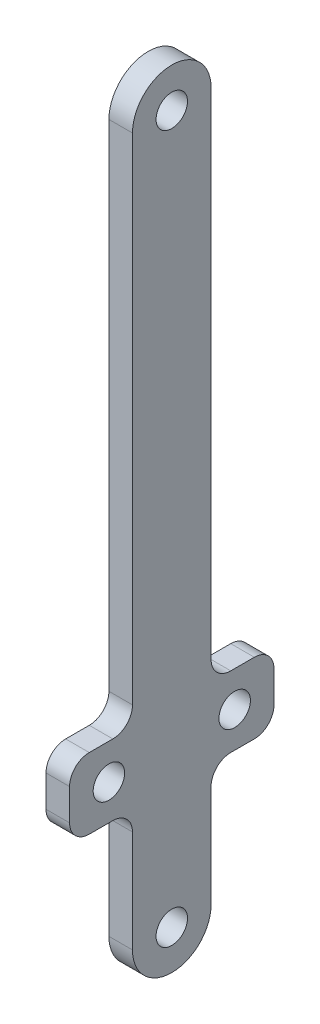
ISO-10303-21;
HEADER;
FILE_DESCRIPTION(('STEP AP214'),'2;1');
FILE_NAME('part.step','',(''),(''),'','','');
FILE_SCHEMA(('AUTOMOTIVE_DESIGN { 1 0 10303 214 1 1 1 1 }'));
ENDSEC;
DATA;
#1=APPLICATION_CONTEXT('core data for automotive mechanical design processes');
#2=APPLICATION_PROTOCOL_DEFINITION('international standard','automotive_design',2000,#1);
#3=PRODUCT_CONTEXT('',#1,'mechanical');
#4=PRODUCT('Part','Part','',(#3));
#5=PRODUCT_RELATED_PRODUCT_CATEGORY('part','',(#4));
#6=PRODUCT_DEFINITION_FORMATION('','',#4);
#7=PRODUCT_DEFINITION_CONTEXT('part definition',#1,'design');
#8=PRODUCT_DEFINITION('design','',#6,#7);
#9=PRODUCT_DEFINITION_SHAPE('','',#8);
#10=(LENGTH_UNIT() NAMED_UNIT(*) SI_UNIT(.MILLI.,.METRE.));
#11=(NAMED_UNIT(*) PLANE_ANGLE_UNIT() SI_UNIT($,.RADIAN.));
#12=(NAMED_UNIT(*) SI_UNIT($,.STERADIAN.) SOLID_ANGLE_UNIT());
#13=UNCERTAINTY_MEASURE_WITH_UNIT(LENGTH_MEASURE(1.E-05),#10,'distance_accuracy_value','');
#14=(GEOMETRIC_REPRESENTATION_CONTEXT(3) GLOBAL_UNCERTAINTY_ASSIGNED_CONTEXT((#13)) GLOBAL_UNIT_ASSIGNED_CONTEXT((#10,
#11,#12)) REPRESENTATION_CONTEXT('',''));
#15=CARTESIAN_POINT('',(0.,0.,0.));
#16=DIRECTION('',(0.,0.,1.));
#17=DIRECTION('',(1.,0.,0.));
#18=AXIS2_PLACEMENT_3D('',#15,#16,#17);
#19=CARTESIAN_POINT('',(6.,49.,0.));
#20=DIRECTION('',(0.,1.,0.));
#21=DIRECTION('',(0.,0.,1.));
#22=AXIS2_PLACEMENT_3D('',#19,#20,#21);
#23=PLANE('',#22);
#24=DIRECTION('',(0.,0.,-1.));
#25=VECTOR('',#24,1.);
#26=CARTESIAN_POINT('',(0.,49.,0.));
#27=LINE('',#26,#25);
#28=CARTESIAN_POINT('',(0.,49.,21.));
#29=VERTEX_POINT('',#28);
#30=CARTESIAN_POINT('',(0.,49.,15.));
#31=VERTEX_POINT('',#30);
#32=EDGE_CURVE('E238',#29,#31,#27,.T.);
#33=ORIENTED_EDGE('',*,*,#32,.F.);
#34=DIRECTION('',(-1.,0.,0.));
#35=VECTOR('',#34,1.);
#36=CARTESIAN_POINT('',(6.,49.,21.));
#37=LINE('',#36,#35);
#38=CARTESIAN_POINT('',(6.,49.,21.));
#39=VERTEX_POINT('',#38);
#40=EDGE_CURVE('E333',#29,#39,#37,.F.);
#41=ORIENTED_EDGE('',*,*,#40,.T.);
#42=DIRECTION('',(0.,0.,-1.));
#43=VECTOR('',#42,1.);
#44=CARTESIAN_POINT('',(6.,49.,0.));
#45=LINE('',#44,#43);
#46=CARTESIAN_POINT('',(6.,49.,15.));
#47=VERTEX_POINT('',#46);
#48=EDGE_CURVE('E358',#39,#47,#45,.T.);
#49=ORIENTED_EDGE('',*,*,#48,.T.);
#50=DIRECTION('',(-1.,0.,0.));
#51=VECTOR('',#50,1.);
#52=CARTESIAN_POINT('',(0.,49.,15.));
#53=LINE('',#52,#51);
#54=EDGE_CURVE('E330',#47,#31,#53,.T.);
#55=ORIENTED_EDGE('',*,*,#54,.T.);
#56=EDGE_LOOP('',(#33,#41,#49,#55));
#57=FACE_BOUND('',#56,.T.);
#58=ADVANCED_FACE('F35',(#57),#23,.T.);
#59=CARTESIAN_POINT('',(6.,0.,26.));
#60=DIRECTION('',(0.,0.,1.));
#61=DIRECTION('',(1.,0.,0.));
#62=AXIS2_PLACEMENT_3D('',#59,#60,#61);
#63=PLANE('',#62);
#64=DIRECTION('',(0.,1.,0.));
#65=VECTOR('',#64,1.);
#66=CARTESIAN_POINT('',(0.,0.,26.));
#67=LINE('',#66,#65);
#68=CARTESIAN_POINT('',(0.,36.,26.));
#69=VERTEX_POINT('',#68);
#70=CARTESIAN_POINT('',(0.,44.,26.));
#71=VERTEX_POINT('',#70);
#72=EDGE_CURVE('E241',#69,#71,#67,.T.);
#73=ORIENTED_EDGE('',*,*,#72,.F.);
#74=DIRECTION('',(-1.,0.,0.));
#75=VECTOR('',#74,1.);
#76=CARTESIAN_POINT('',(6.,36.,26.));
#77=LINE('',#76,#75);
#78=CARTESIAN_POINT('',(6.,36.,26.));
#79=VERTEX_POINT('',#78);
#80=EDGE_CURVE('E328',#69,#79,#77,.F.);
#81=ORIENTED_EDGE('',*,*,#80,.T.);
#82=DIRECTION('',(0.,1.,0.));
#83=VECTOR('',#82,1.);
#84=CARTESIAN_POINT('',(6.,0.,26.));
#85=LINE('',#84,#83);
#86=CARTESIAN_POINT('',(6.,44.,26.));
#87=VERTEX_POINT('',#86);
#88=EDGE_CURVE('E206',#79,#87,#85,.T.);
#89=ORIENTED_EDGE('',*,*,#88,.T.);
#90=DIRECTION('',(-1.,0.,0.));
#91=VECTOR('',#90,1.);
#92=CARTESIAN_POINT('',(6.,44.,26.));
#93=LINE('',#92,#91);
#94=EDGE_CURVE('E325',#87,#71,#93,.T.);
#95=ORIENTED_EDGE('',*,*,#94,.T.);
#96=EDGE_LOOP('',(#73,#81,#89,#95));
#97=FACE_BOUND('',#96,.T.);
#98=ADVANCED_FACE('F384',(#97),#63,.T.);
#99=CARTESIAN_POINT('',(6.,31.,0.));
#100=DIRECTION('',(0.,1.,0.));
#101=DIRECTION('',(0.,0.,1.));
#102=AXIS2_PLACEMENT_3D('',#99,#100,#101);
#103=PLANE('',#102);
#104=DIRECTION('',(0.,0.,-1.));
#105=VECTOR('',#104,1.);
#106=CARTESIAN_POINT('',(0.,31.,0.));
#107=LINE('',#106,#105);
#108=CARTESIAN_POINT('',(0.,31.,21.));
#109=VERTEX_POINT('',#108);
#110=CARTESIAN_POINT('',(0.,31.,15.));
#111=VERTEX_POINT('',#110);
#112=EDGE_CURVE('E244',#109,#111,#107,.T.);
#113=ORIENTED_EDGE('',*,*,#112,.T.);
#114=DIRECTION('',(-1.,0.,0.));
#115=VECTOR('',#114,1.);
#116=CARTESIAN_POINT('',(6.,31.,15.));
#117=LINE('',#116,#115);
#118=CARTESIAN_POINT('',(6.,31.,15.));
#119=VERTEX_POINT('',#118);
#120=EDGE_CURVE('E323',#111,#119,#117,.F.);
#121=ORIENTED_EDGE('',*,*,#120,.T.);
#122=DIRECTION('',(0.,0.,-1.));
#123=VECTOR('',#122,1.);
#124=CARTESIAN_POINT('',(6.,31.,0.));
#125=LINE('',#124,#123);
#126=CARTESIAN_POINT('',(6.,31.,21.));
#127=VERTEX_POINT('',#126);
#128=EDGE_CURVE('E204',#127,#119,#125,.T.);
#129=ORIENTED_EDGE('',*,*,#128,.F.);
#130=DIRECTION('',(-1.,0.,0.));
#131=VECTOR('',#130,1.);
#132=CARTESIAN_POINT('',(0.,31.,21.));
#133=LINE('',#132,#131);
#134=EDGE_CURVE('E320',#127,#109,#133,.T.);
#135=ORIENTED_EDGE('',*,*,#134,.T.);
#136=EDGE_LOOP('',(#113,#121,#129,#135));
#137=FACE_BOUND('',#136,.T.);
#138=ADVANCED_FACE('F389',(#137),#103,.F.);
#139=CARTESIAN_POINT('',(6.,0.,10.));
#140=DIRECTION('',(0.,0.,1.));
#141=DIRECTION('',(1.,0.,0.));
#142=AXIS2_PLACEMENT_3D('',#139,#140,#141);
#143=PLANE('',#142);
#144=DIRECTION('',(0.,1.,0.));
#145=VECTOR('',#144,1.);
#146=CARTESIAN_POINT('',(6.,0.,10.));
#147=LINE('',#146,#145);
#148=CARTESIAN_POINT('',(6.,0.,10.));
#149=VERTEX_POINT('',#148);
#150=CARTESIAN_POINT('',(6.,26.,10.));
#151=VERTEX_POINT('',#150);
#152=EDGE_CURVE('E179',#149,#151,#147,.T.);
#153=ORIENTED_EDGE('',*,*,#152,.T.);
#154=DIRECTION('',(-1.,0.,0.));
#155=VECTOR('',#154,1.);
#156=CARTESIAN_POINT('',(6.,26.,10.));
#157=LINE('',#156,#155);
#158=CARTESIAN_POINT('',(0.,26.,10.));
#159=VERTEX_POINT('',#158);
#160=EDGE_CURVE('E318',#151,#159,#157,.T.);
#161=ORIENTED_EDGE('',*,*,#160,.T.);
#162=DIRECTION('',(0.,1.,0.));
#163=VECTOR('',#162,1.);
#164=CARTESIAN_POINT('',(0.,0.,10.));
#165=LINE('',#164,#163);
#166=CARTESIAN_POINT('',(0.,0.,10.));
#167=VERTEX_POINT('',#166);
#168=EDGE_CURVE('E182',#167,#159,#165,.T.);
#169=ORIENTED_EDGE('',*,*,#168,.F.);
#170=DIRECTION('',(-1.,0.,0.));
#171=VECTOR('',#170,1.);
#172=CARTESIAN_POINT('',(6.,0.,10.));
#173=LINE('',#172,#171);
#174=EDGE_CURVE('E174',#149,#167,#173,.T.);
#175=ORIENTED_EDGE('',*,*,#174,.F.);
#176=EDGE_LOOP('',(#153,#161,#169,#175));
#177=FACE_BOUND('',#176,.T.);
#178=ADVANCED_FACE('F176',(#177),#143,.T.);
#179=CARTESIAN_POINT('',(6.,0.,0.));
#180=DIRECTION('',(-1.,0.,0.));
#181=DIRECTION('',(0.,0.,1.));
#182=AXIS2_PLACEMENT_3D('',#179,#180,#181);
#183=CYLINDRICAL_SURFACE('',#182,10.);
#184=CARTESIAN_POINT('',(0.,0.,0.));
#185=DIRECTION('',(1.,0.,0.));
#186=DIRECTION('',(0.,0.,-1.));
#187=AXIS2_PLACEMENT_3D('',#184,#185,#186);
#188=CIRCLE('',#187,10.);
#189=CARTESIAN_POINT('',(0.,0.,-10.));
#190=VERTEX_POINT('',#189);
#191=EDGE_CURVE('E248',#167,#190,#188,.T.);
#192=ORIENTED_EDGE('',*,*,#191,.T.);
#193=DIRECTION('',(-1.,0.,0.));
#194=VECTOR('',#193,1.);
#195=CARTESIAN_POINT('',(6.,0.,-10.));
#196=LINE('',#195,#194);
#197=CARTESIAN_POINT('',(6.,0.,-10.));
#198=VERTEX_POINT('',#197);
#199=EDGE_CURVE('E187',#198,#190,#196,.T.);
#200=ORIENTED_EDGE('',*,*,#199,.F.);
#201=CARTESIAN_POINT('',(6.,0.,0.));
#202=DIRECTION('',(1.,0.,0.));
#203=DIRECTION('',(0.,0.,-1.));
#204=AXIS2_PLACEMENT_3D('',#201,#202,#203);
#205=CIRCLE('',#204,10.);
#206=EDGE_CURVE('E191',#149,#198,#205,.T.);
#207=ORIENTED_EDGE('',*,*,#206,.F.);
#208=ORIENTED_EDGE('',*,*,#174,.T.);
#209=EDGE_LOOP('',(#192,#200,#207,#208));
#210=FACE_BOUND('',#209,.T.);
#211=ADVANCED_FACE('F192',(#210),#183,.T.);
#212=CARTESIAN_POINT('',(6.,0.,-10.));
#213=DIRECTION('',(0.,0.,1.));
#214=DIRECTION('',(1.,0.,0.));
#215=AXIS2_PLACEMENT_3D('',#212,#213,#214);
#216=PLANE('',#215);
#217=DIRECTION('',(0.,1.,0.));
#218=VECTOR('',#217,1.);
#219=CARTESIAN_POINT('',(0.,0.,-10.));
#220=LINE('',#219,#218);
#221=CARTESIAN_POINT('',(0.,26.,-10.));
#222=VERTEX_POINT('',#221);
#223=EDGE_CURVE('E250',#190,#222,#220,.T.);
#224=ORIENTED_EDGE('',*,*,#223,.T.);
#225=DIRECTION('',(-1.,0.,0.));
#226=VECTOR('',#225,1.);
#227=CARTESIAN_POINT('',(6.,26.,-10.));
#228=LINE('',#227,#226);
#229=CARTESIAN_POINT('',(6.,26.,-10.));
#230=VERTEX_POINT('',#229);
#231=EDGE_CURVE('E316',#222,#230,#228,.F.);
#232=ORIENTED_EDGE('',*,*,#231,.T.);
#233=DIRECTION('',(0.,1.,0.));
#234=VECTOR('',#233,1.);
#235=CARTESIAN_POINT('',(6.,0.,-10.));
#236=LINE('',#235,#234);
#237=EDGE_CURVE('E196',#198,#230,#236,.T.);
#238=ORIENTED_EDGE('',*,*,#237,.F.);
#239=ORIENTED_EDGE('',*,*,#199,.T.);
#240=EDGE_LOOP('',(#224,#232,#238,#239));
#241=FACE_BOUND('',#240,.T.);
#242=ADVANCED_FACE('F437',(#241),#216,.F.);
#243=CARTESIAN_POINT('',(6.,31.,0.));
#244=DIRECTION('',(0.,1.,0.));
#245=DIRECTION('',(0.,0.,1.));
#246=AXIS2_PLACEMENT_3D('',#243,#244,#245);
#247=PLANE('',#246);
#248=DIRECTION('',(0.,0.,-1.));
#249=VECTOR('',#248,1.);
#250=CARTESIAN_POINT('',(0.,31.,0.));
#251=LINE('',#250,#249);
#252=CARTESIAN_POINT('',(0.,31.,-15.));
#253=VERTEX_POINT('',#252);
#254=CARTESIAN_POINT('',(0.,31.,-21.));
#255=VERTEX_POINT('',#254);
#256=EDGE_CURVE('E253',#253,#255,#251,.T.);
#257=ORIENTED_EDGE('',*,*,#256,.T.);
#258=DIRECTION('',(-1.,0.,0.));
#259=VECTOR('',#258,1.);
#260=CARTESIAN_POINT('',(6.,31.,-21.));
#261=LINE('',#260,#259);
#262=CARTESIAN_POINT('',(6.,31.,-21.));
#263=VERTEX_POINT('',#262);
#264=EDGE_CURVE('E58',#255,#263,#261,.F.);
#265=ORIENTED_EDGE('',*,*,#264,.T.);
#266=DIRECTION('',(0.,0.,-1.));
#267=VECTOR('',#266,1.);
#268=CARTESIAN_POINT('',(6.,31.,0.));
#269=LINE('',#268,#267);
#270=CARTESIAN_POINT('',(6.,31.,-15.));
#271=VERTEX_POINT('',#270);
#272=EDGE_CURVE('E211',#271,#263,#269,.T.);
#273=ORIENTED_EDGE('',*,*,#272,.F.);
#274=DIRECTION('',(-1.,0.,0.));
#275=VECTOR('',#274,1.);
#276=CARTESIAN_POINT('',(0.,31.,-15.));
#277=LINE('',#276,#275);
#278=EDGE_CURVE('E312',#271,#253,#277,.T.);
#279=ORIENTED_EDGE('',*,*,#278,.T.);
#280=EDGE_LOOP('',(#257,#265,#273,#279));
#281=FACE_BOUND('',#280,.T.);
#282=ADVANCED_FACE('F440',(#281),#247,.F.);
#283=CARTESIAN_POINT('',(6.,0.,-26.));
#284=DIRECTION('',(0.,0.,1.));
#285=DIRECTION('',(1.,0.,0.));
#286=AXIS2_PLACEMENT_3D('',#283,#284,#285);
#287=PLANE('',#286);
#288=DIRECTION('',(0.,1.,0.));
#289=VECTOR('',#288,1.);
#290=CARTESIAN_POINT('',(0.,0.,-26.));
#291=LINE('',#290,#289);
#292=CARTESIAN_POINT('',(0.,36.,-26.));
#293=VERTEX_POINT('',#292);
#294=CARTESIAN_POINT('',(0.,44.,-26.));
#295=VERTEX_POINT('',#294);
#296=EDGE_CURVE('E255',#293,#295,#291,.T.);
#297=ORIENTED_EDGE('',*,*,#296,.T.);
#298=DIRECTION('',(-1.,0.,0.));
#299=VECTOR('',#298,1.);
#300=CARTESIAN_POINT('',(6.,44.,-26.));
#301=LINE('',#300,#299);
#302=CARTESIAN_POINT('',(6.,44.,-26.));
#303=VERTEX_POINT('',#302);
#304=EDGE_CURVE('E302',#295,#303,#301,.F.);
#305=ORIENTED_EDGE('',*,*,#304,.T.);
#306=DIRECTION('',(0.,1.,0.));
#307=VECTOR('',#306,1.);
#308=CARTESIAN_POINT('',(6.,0.,-26.));
#309=LINE('',#308,#307);
#310=CARTESIAN_POINT('',(6.,36.,-26.));
#311=VERTEX_POINT('',#310);
#312=EDGE_CURVE('E213',#311,#303,#309,.T.);
#313=ORIENTED_EDGE('',*,*,#312,.F.);
#314=DIRECTION('',(-1.,0.,0.));
#315=VECTOR('',#314,1.);
#316=CARTESIAN_POINT('',(6.,36.,-26.));
#317=LINE('',#316,#315);
#318=EDGE_CURVE('E299',#311,#293,#317,.T.);
#319=ORIENTED_EDGE('',*,*,#318,.T.);
#320=EDGE_LOOP('',(#297,#305,#313,#319));
#321=FACE_BOUND('',#320,.T.);
#322=ADVANCED_FACE('F446',(#321),#287,.F.);
#323=CARTESIAN_POINT('',(6.,49.,0.));
#324=DIRECTION('',(0.,1.,0.));
#325=DIRECTION('',(0.,0.,1.));
#326=AXIS2_PLACEMENT_3D('',#323,#324,#325);
#327=PLANE('',#326);
#328=DIRECTION('',(0.,0.,-1.));
#329=VECTOR('',#328,1.);
#330=CARTESIAN_POINT('',(0.,49.,0.));
#331=LINE('',#330,#329);
#332=CARTESIAN_POINT('',(0.,49.,-15.));
#333=VERTEX_POINT('',#332);
#334=CARTESIAN_POINT('',(0.,49.,-21.));
#335=VERTEX_POINT('',#334);
#336=EDGE_CURVE('E258',#333,#335,#331,.T.);
#337=ORIENTED_EDGE('',*,*,#336,.F.);
#338=DIRECTION('',(-1.,0.,0.));
#339=VECTOR('',#338,1.);
#340=CARTESIAN_POINT('',(6.,49.,-15.));
#341=LINE('',#340,#339);
#342=CARTESIAN_POINT('',(6.,49.,-15.));
#343=VERTEX_POINT('',#342);
#344=EDGE_CURVE('E289',#333,#343,#341,.F.);
#345=ORIENTED_EDGE('',*,*,#344,.T.);
#346=DIRECTION('',(0.,0.,-1.));
#347=VECTOR('',#346,1.);
#348=CARTESIAN_POINT('',(6.,49.,0.));
#349=LINE('',#348,#347);
#350=CARTESIAN_POINT('',(6.,49.,-21.));
#351=VERTEX_POINT('',#350);
#352=EDGE_CURVE('E215',#343,#351,#349,.T.);
#353=ORIENTED_EDGE('',*,*,#352,.T.);
#354=DIRECTION('',(-1.,0.,0.));
#355=VECTOR('',#354,1.);
#356=CARTESIAN_POINT('',(0.,49.,-21.));
#357=LINE('',#356,#355);
#358=EDGE_CURVE('E286',#351,#335,#357,.T.);
#359=ORIENTED_EDGE('',*,*,#358,.T.);
#360=EDGE_LOOP('',(#337,#345,#353,#359));
#361=FACE_BOUND('',#360,.T.);
#362=ADVANCED_FACE('F453',(#361),#327,.T.);
#363=CARTESIAN_POINT('',(6.,0.,-10.));
#364=DIRECTION('',(0.,0.,1.));
#365=DIRECTION('',(1.,0.,0.));
#366=AXIS2_PLACEMENT_3D('',#363,#364,#365);
#367=PLANE('',#366);
#368=DIRECTION('',(0.,1.,0.));
#369=VECTOR('',#368,1.);
#370=CARTESIAN_POINT('',(6.,0.,-10.));
#371=LINE('',#370,#369);
#372=CARTESIAN_POINT('',(6.,54.,-10.));
#373=VERTEX_POINT('',#372);
#374=CARTESIAN_POINT('',(6.,180.,-10.));
#375=VERTEX_POINT('',#374);
#376=EDGE_CURVE('E218',#373,#375,#371,.T.);
#377=ORIENTED_EDGE('',*,*,#376,.F.);
#378=DIRECTION('',(-1.,0.,0.));
#379=VECTOR('',#378,1.);
#380=CARTESIAN_POINT('',(6.,54.,-10.));
#381=LINE('',#380,#379);
#382=CARTESIAN_POINT('',(0.,54.,-10.));
#383=VERTEX_POINT('',#382);
#384=EDGE_CURVE('E186',#373,#383,#381,.T.);
#385=ORIENTED_EDGE('',*,*,#384,.T.);
#386=DIRECTION('',(0.,1.,0.));
#387=VECTOR('',#386,1.);
#388=CARTESIAN_POINT('',(0.,0.,-10.));
#389=LINE('',#388,#387);
#390=CARTESIAN_POINT('',(0.,180.,-10.));
#391=VERTEX_POINT('',#390);
#392=EDGE_CURVE('E261',#383,#391,#389,.T.);
#393=ORIENTED_EDGE('',*,*,#392,.T.);
#394=DIRECTION('',(-1.,0.,0.));
#395=VECTOR('',#394,1.);
#396=CARTESIAN_POINT('',(6.,180.,-10.));
#397=LINE('',#396,#395);
#398=EDGE_CURVE('E280',#375,#391,#397,.T.);
#399=ORIENTED_EDGE('',*,*,#398,.F.);
#400=EDGE_LOOP('',(#377,#385,#393,#399));
#401=FACE_BOUND('',#400,.T.);
#402=ADVANCED_FACE('F460',(#401),#367,.F.);
#403=CARTESIAN_POINT('',(6.,180.,0.));
#404=DIRECTION('',(-1.,0.,0.));
#405=DIRECTION('',(0.,0.,1.));
#406=AXIS2_PLACEMENT_3D('',#403,#404,#405);
#407=CYLINDRICAL_SURFACE('',#406,10.);
#408=CARTESIAN_POINT('',(0.,180.,0.));
#409=DIRECTION('',(1.,0.,0.));
#410=DIRECTION('',(0.,0.,-1.));
#411=AXIS2_PLACEMENT_3D('',#408,#409,#410);
#412=CIRCLE('',#411,10.);
#413=CARTESIAN_POINT('',(0.,180.,10.));
#414=VERTEX_POINT('',#413);
#415=EDGE_CURVE('E263',#391,#414,#412,.T.);
#416=ORIENTED_EDGE('',*,*,#415,.T.);
#417=DIRECTION('',(-1.,0.,0.));
#418=VECTOR('',#417,1.);
#419=CARTESIAN_POINT('',(6.,180.,10.));
#420=LINE('',#419,#418);
#421=CARTESIAN_POINT('',(6.,180.,10.));
#422=VERTEX_POINT('',#421);
#423=EDGE_CURVE('E234',#422,#414,#420,.T.);
#424=ORIENTED_EDGE('',*,*,#423,.F.);
#425=CARTESIAN_POINT('',(6.,180.,0.));
#426=DIRECTION('',(1.,0.,0.));
#427=DIRECTION('',(0.,0.,-1.));
#428=AXIS2_PLACEMENT_3D('',#425,#426,#427);
#429=CIRCLE('',#428,10.);
#430=EDGE_CURVE('E220',#375,#422,#429,.T.);
#431=ORIENTED_EDGE('',*,*,#430,.F.);
#432=ORIENTED_EDGE('',*,*,#398,.T.);
#433=EDGE_LOOP('',(#416,#424,#431,#432));
#434=FACE_BOUND('',#433,.T.);
#435=ADVANCED_FACE('F464',(#434),#407,.T.);
#436=CARTESIAN_POINT('',(6.,0.,0.));
#437=DIRECTION('',(-1.,0.,0.));
#438=DIRECTION('',(0.,0.,1.));
#439=AXIS2_PLACEMENT_3D('',#436,#437,#438);
#440=CYLINDRICAL_SURFACE('',#439,4.);
#441=CARTESIAN_POINT('',(6.,0.,0.));
#442=DIRECTION('',(1.,0.,0.));
#443=DIRECTION('',(0.,0.,-1.));
#444=AXIS2_PLACEMENT_3D('',#441,#442,#443);
#445=CIRCLE('',#444,4.);
#446=CARTESIAN_POINT('',(6.,0.,-4.));
#447=VERTEX_POINT('',#446);
#448=EDGE_CURVE('E228',#447,#447,#445,.T.);
#449=ORIENTED_EDGE('',*,*,#448,.T.);
#450=EDGE_LOOP('',(#449));
#451=FACE_BOUND('',#450,.T.);
#452=CARTESIAN_POINT('',(0.,0.,0.));
#453=DIRECTION('',(1.,0.,0.));
#454=DIRECTION('',(0.,0.,-1.));
#455=AXIS2_PLACEMENT_3D('',#452,#453,#454);
#456=CIRCLE('',#455,4.);
#457=CARTESIAN_POINT('',(0.,0.,-4.));
#458=VERTEX_POINT('',#457);
#459=EDGE_CURVE('E271',#458,#458,#456,.T.);
#460=ORIENTED_EDGE('',*,*,#459,.F.);
#461=EDGE_LOOP('',(#460));
#462=FACE_BOUND('',#461,.T.);
#463=ADVANCED_FACE('F466',(#451,#462),#440,.F.);
#464=CARTESIAN_POINT('',(6.,40.,-16.));
#465=DIRECTION('',(-1.,0.,0.));
#466=DIRECTION('',(0.,0.,1.));
#467=AXIS2_PLACEMENT_3D('',#464,#465,#466);
#468=CYLINDRICAL_SURFACE('',#467,4.);
#469=CARTESIAN_POINT('',(6.,40.,-16.));
#470=DIRECTION('',(1.,0.,0.));
#471=DIRECTION('',(0.,0.,-1.));
#472=AXIS2_PLACEMENT_3D('',#469,#470,#471);
#473=CIRCLE('',#472,4.);
#474=CARTESIAN_POINT('',(6.,40.,-20.));
#475=VERTEX_POINT('',#474);
#476=EDGE_CURVE('E225',#475,#475,#473,.F.);
#477=ORIENTED_EDGE('',*,*,#476,.F.);
#478=EDGE_LOOP('',(#477));
#479=FACE_BOUND('',#478,.T.);
#480=CARTESIAN_POINT('',(0.,40.,-16.));
#481=DIRECTION('',(1.,0.,0.));
#482=DIRECTION('',(0.,0.,-1.));
#483=AXIS2_PLACEMENT_3D('',#480,#481,#482);
#484=CIRCLE('',#483,4.);
#485=CARTESIAN_POINT('',(0.,40.,-20.));
#486=VERTEX_POINT('',#485);
#487=EDGE_CURVE('E268',#486,#486,#484,.F.);
#488=ORIENTED_EDGE('',*,*,#487,.T.);
#489=EDGE_LOOP('',(#488));
#490=FACE_BOUND('',#489,.T.);
#491=ADVANCED_FACE('F472',(#479,#490),#468,.F.);
#492=CARTESIAN_POINT('',(6.,0.,10.));
#493=DIRECTION('',(0.,0.,1.));
#494=DIRECTION('',(1.,0.,0.));
#495=AXIS2_PLACEMENT_3D('',#492,#493,#494);
#496=PLANE('',#495);
#497=DIRECTION('',(0.,1.,0.));
#498=VECTOR('',#497,1.);
#499=CARTESIAN_POINT('',(0.,0.,10.));
#500=LINE('',#499,#498);
#501=CARTESIAN_POINT('',(0.,54.,10.));
#502=VERTEX_POINT('',#501);
#503=EDGE_CURVE('E266',#502,#414,#500,.T.);
#504=ORIENTED_EDGE('',*,*,#503,.F.);
#505=DIRECTION('',(-1.,0.,0.));
#506=VECTOR('',#505,1.);
#507=CARTESIAN_POINT('',(6.,54.,10.));
#508=LINE('',#507,#506);
#509=CARTESIAN_POINT('',(6.,54.,10.));
#510=VERTEX_POINT('',#509);
#511=EDGE_CURVE('E50',#502,#510,#508,.F.);
#512=ORIENTED_EDGE('',*,*,#511,.T.);
#513=DIRECTION('',(0.,1.,0.));
#514=VECTOR('',#513,1.);
#515=CARTESIAN_POINT('',(6.,0.,10.));
#516=LINE('',#515,#514);
#517=EDGE_CURVE('E223',#510,#422,#516,.T.);
#518=ORIENTED_EDGE('',*,*,#517,.T.);
#519=ORIENTED_EDGE('',*,*,#423,.T.);
#520=EDGE_LOOP('',(#504,#512,#518,#519));
#521=FACE_BOUND('',#520,.T.);
#522=ADVANCED_FACE('F353',(#521),#496,.T.);
#523=CARTESIAN_POINT('',(6.,40.,16.));
#524=DIRECTION('',(-1.,0.,0.));
#525=DIRECTION('',(0.,0.,1.));
#526=AXIS2_PLACEMENT_3D('',#523,#524,#525);
#527=CYLINDRICAL_SURFACE('',#526,4.);
#528=CARTESIAN_POINT('',(6.,40.,16.));
#529=DIRECTION('',(1.,0.,0.));
#530=DIRECTION('',(0.,0.,-1.));
#531=AXIS2_PLACEMENT_3D('',#528,#529,#530);
#532=CIRCLE('',#531,4.);
#533=CARTESIAN_POINT('',(6.,40.,12.));
#534=VERTEX_POINT('',#533);
#535=EDGE_CURVE('E277',#534,#534,#532,.T.);
#536=ORIENTED_EDGE('',*,*,#535,.T.);
#537=EDGE_LOOP('',(#536));
#538=FACE_BOUND('',#537,.T.);
#539=CARTESIAN_POINT('',(0.,40.,16.));
#540=DIRECTION('',(1.,0.,0.));
#541=DIRECTION('',(0.,0.,-1.));
#542=AXIS2_PLACEMENT_3D('',#539,#540,#541);
#543=CIRCLE('',#542,4.);
#544=CARTESIAN_POINT('',(0.,40.,12.));
#545=VERTEX_POINT('',#544);
#546=EDGE_CURVE('E235',#545,#545,#543,.T.);
#547=ORIENTED_EDGE('',*,*,#546,.F.);
#548=EDGE_LOOP('',(#547));
#549=FACE_BOUND('',#548,.T.);
#550=ADVANCED_FACE('F368',(#538,#549),#527,.F.);
#551=CARTESIAN_POINT('',(6.,180.,0.));
#552=DIRECTION('',(-1.,0.,0.));
#553=DIRECTION('',(0.,0.,1.));
#554=AXIS2_PLACEMENT_3D('',#551,#552,#553);
#555=CYLINDRICAL_SURFACE('',#554,4.);
#556=CARTESIAN_POINT('',(6.,180.,0.));
#557=DIRECTION('',(1.,0.,0.));
#558=DIRECTION('',(0.,0.,-1.));
#559=AXIS2_PLACEMENT_3D('',#556,#557,#558);
#560=CIRCLE('',#559,4.);
#561=CARTESIAN_POINT('',(6.,180.,-4.));
#562=VERTEX_POINT('',#561);
#563=EDGE_CURVE('E231',#562,#562,#560,.T.);
#564=ORIENTED_EDGE('',*,*,#563,.T.);
#565=EDGE_LOOP('',(#564));
#566=FACE_BOUND('',#565,.T.);
#567=CARTESIAN_POINT('',(0.,180.,0.));
#568=DIRECTION('',(1.,0.,0.));
#569=DIRECTION('',(0.,0.,-1.));
#570=AXIS2_PLACEMENT_3D('',#567,#568,#569);
#571=CIRCLE('',#570,4.);
#572=CARTESIAN_POINT('',(0.,180.,-4.));
#573=VERTEX_POINT('',#572);
#574=EDGE_CURVE('E274',#573,#573,#571,.T.);
#575=ORIENTED_EDGE('',*,*,#574,.F.);
#576=EDGE_LOOP('',(#575));
#577=FACE_BOUND('',#576,.T.);
#578=ADVANCED_FACE('F372',(#566,#577),#555,.F.);
#579=CARTESIAN_POINT('',(6.,0.,0.));
#580=DIRECTION('',(1.,0.,0.));
#581=DIRECTION('',(0.,0.,-1.));
#582=AXIS2_PLACEMENT_3D('',#579,#580,#581);
#583=PLANE('',#582);
#584=ORIENTED_EDGE('',*,*,#535,.F.);
#585=EDGE_LOOP('',(#584));
#586=FACE_BOUND('',#585,.T.);
#587=ORIENTED_EDGE('',*,*,#312,.T.);
#588=CARTESIAN_POINT('',(6.,44.,-21.));
#589=DIRECTION('',(1.,0.,0.));
#590=DIRECTION('',(0.,0.,-1.));
#591=AXIS2_PLACEMENT_3D('',#588,#589,#590);
#592=CIRCLE('',#591,5.);
#593=EDGE_CURVE('E310',#303,#351,#592,.T.);
#594=ORIENTED_EDGE('',*,*,#593,.T.);
#595=ORIENTED_EDGE('',*,*,#352,.F.);
#596=CARTESIAN_POINT('',(6.,54.,-15.));
#597=DIRECTION('',(1.,0.,0.));
#598=DIRECTION('',(0.,0.,-1.));
#599=AXIS2_PLACEMENT_3D('',#596,#597,#598);
#600=CIRCLE('',#599,5.);
#601=EDGE_CURVE('E338',#343,#373,#600,.F.);
#602=ORIENTED_EDGE('',*,*,#601,.T.);
#603=ORIENTED_EDGE('',*,*,#376,.T.);
#604=ORIENTED_EDGE('',*,*,#430,.T.);
#605=ORIENTED_EDGE('',*,*,#517,.F.);
#606=CARTESIAN_POINT('',(6.,54.,15.));
#607=DIRECTION('',(1.,0.,0.));
#608=DIRECTION('',(0.,0.,-1.));
#609=AXIS2_PLACEMENT_3D('',#606,#607,#608);
#610=CIRCLE('',#609,5.);
#611=EDGE_CURVE('E11',#510,#47,#610,.F.);
#612=ORIENTED_EDGE('',*,*,#611,.T.);
#613=ORIENTED_EDGE('',*,*,#48,.F.);
#614=CARTESIAN_POINT('',(6.,44.,21.));
#615=DIRECTION('',(1.,0.,0.));
#616=DIRECTION('',(0.,0.,-1.));
#617=AXIS2_PLACEMENT_3D('',#614,#615,#616);
#618=CIRCLE('',#617,5.);
#619=EDGE_CURVE('E304',#39,#87,#618,.T.);
#620=ORIENTED_EDGE('',*,*,#619,.T.);
#621=ORIENTED_EDGE('',*,*,#88,.F.);
#622=CARTESIAN_POINT('',(6.,36.,21.));
#623=DIRECTION('',(1.,0.,0.));
#624=DIRECTION('',(0.,0.,-1.));
#625=AXIS2_PLACEMENT_3D('',#622,#623,#624);
#626=CIRCLE('',#625,5.);
#627=EDGE_CURVE('E306',#79,#127,#626,.T.);
#628=ORIENTED_EDGE('',*,*,#627,.T.);
#629=ORIENTED_EDGE('',*,*,#128,.T.);
#630=CARTESIAN_POINT('',(6.,26.,15.));
#631=DIRECTION('',(1.,0.,0.));
#632=DIRECTION('',(0.,0.,-1.));
#633=AXIS2_PLACEMENT_3D('',#630,#631,#632);
#634=CIRCLE('',#633,5.);
#635=EDGE_CURVE('E203',#119,#151,#634,.F.);
#636=ORIENTED_EDGE('',*,*,#635,.T.);
#637=ORIENTED_EDGE('',*,*,#152,.F.);
#638=ORIENTED_EDGE('',*,*,#206,.T.);
#639=ORIENTED_EDGE('',*,*,#237,.T.);
#640=CARTESIAN_POINT('',(6.,26.,-15.));
#641=DIRECTION('',(1.,0.,0.));
#642=DIRECTION('',(0.,0.,-1.));
#643=AXIS2_PLACEMENT_3D('',#640,#641,#642);
#644=CIRCLE('',#643,5.);
#645=EDGE_CURVE('E342',#230,#271,#644,.F.);
#646=ORIENTED_EDGE('',*,*,#645,.T.);
#647=ORIENTED_EDGE('',*,*,#272,.T.);
#648=CARTESIAN_POINT('',(6.,36.,-21.));
#649=DIRECTION('',(1.,0.,0.));
#650=DIRECTION('',(0.,0.,-1.));
#651=AXIS2_PLACEMENT_3D('',#648,#649,#650);
#652=CIRCLE('',#651,5.);
#653=EDGE_CURVE('E308',#263,#311,#652,.T.);
#654=ORIENTED_EDGE('',*,*,#653,.T.);
#655=EDGE_LOOP('',(#587,#594,#595,#602,#603,#604,#605,#612,#613,#620,#621,#628,#629,#636,#637,
#638,#639,#646,#647,#654));
#656=FACE_BOUND('',#655,.T.);
#657=ORIENTED_EDGE('',*,*,#476,.T.);
#658=EDGE_LOOP('',(#657));
#659=FACE_BOUND('',#658,.T.);
#660=ORIENTED_EDGE('',*,*,#448,.F.);
#661=EDGE_LOOP('',(#660));
#662=FACE_BOUND('',#661,.T.);
#663=ORIENTED_EDGE('',*,*,#563,.F.);
#664=EDGE_LOOP('',(#663));
#665=FACE_BOUND('',#664,.T.);
#666=ADVANCED_FACE('F199',(#586,#656,#659,#662,#665),#583,.T.);
#667=CARTESIAN_POINT('',(0.,0.,0.));
#668=DIRECTION('',(1.,0.,0.));
#669=DIRECTION('',(0.,0.,-1.));
#670=AXIS2_PLACEMENT_3D('',#667,#668,#669);
#671=PLANE('',#670);
#672=ORIENTED_EDGE('',*,*,#546,.T.);
#673=EDGE_LOOP('',(#672));
#674=FACE_BOUND('',#673,.T.);
#675=ORIENTED_EDGE('',*,*,#336,.T.);
#676=CARTESIAN_POINT('',(0.,44.,-21.));
#677=DIRECTION('',(1.,0.,0.));
#678=DIRECTION('',(0.,0.,-1.));
#679=AXIS2_PLACEMENT_3D('',#676,#677,#678);
#680=CIRCLE('',#679,5.);
#681=EDGE_CURVE('E297',#335,#295,#680,.F.);
#682=ORIENTED_EDGE('',*,*,#681,.T.);
#683=ORIENTED_EDGE('',*,*,#296,.F.);
#684=CARTESIAN_POINT('',(0.,36.,-21.));
#685=DIRECTION('',(1.,0.,0.));
#686=DIRECTION('',(0.,0.,-1.));
#687=AXIS2_PLACEMENT_3D('',#684,#685,#686);
#688=CIRCLE('',#687,5.);
#689=EDGE_CURVE('E295',#293,#255,#688,.F.);
#690=ORIENTED_EDGE('',*,*,#689,.T.);
#691=ORIENTED_EDGE('',*,*,#256,.F.);
#692=CARTESIAN_POINT('',(0.,26.,-15.));
#693=DIRECTION('',(1.,0.,0.));
#694=DIRECTION('',(0.,0.,-1.));
#695=AXIS2_PLACEMENT_3D('',#692,#693,#694);
#696=CIRCLE('',#695,5.);
#697=EDGE_CURVE('E340',#253,#222,#696,.T.);
#698=ORIENTED_EDGE('',*,*,#697,.T.);
#699=ORIENTED_EDGE('',*,*,#223,.F.);
#700=ORIENTED_EDGE('',*,*,#191,.F.);
#701=ORIENTED_EDGE('',*,*,#168,.T.);
#702=CARTESIAN_POINT('',(0.,26.,15.));
#703=DIRECTION('',(1.,0.,0.));
#704=DIRECTION('',(0.,0.,-1.));
#705=AXIS2_PLACEMENT_3D('',#702,#703,#704);
#706=CIRCLE('',#705,5.);
#707=EDGE_CURVE('E344',#159,#111,#706,.T.);
#708=ORIENTED_EDGE('',*,*,#707,.T.);
#709=ORIENTED_EDGE('',*,*,#112,.F.);
#710=CARTESIAN_POINT('',(0.,36.,21.));
#711=DIRECTION('',(1.,0.,0.));
#712=DIRECTION('',(0.,0.,-1.));
#713=AXIS2_PLACEMENT_3D('',#710,#711,#712);
#714=CIRCLE('',#713,5.);
#715=EDGE_CURVE('E293',#109,#69,#714,.F.);
#716=ORIENTED_EDGE('',*,*,#715,.T.);
#717=ORIENTED_EDGE('',*,*,#72,.T.);
#718=CARTESIAN_POINT('',(0.,44.,21.));
#719=DIRECTION('',(1.,0.,0.));
#720=DIRECTION('',(0.,0.,-1.));
#721=AXIS2_PLACEMENT_3D('',#718,#719,#720);
#722=CIRCLE('',#721,5.);
#723=EDGE_CURVE('E291',#71,#29,#722,.F.);
#724=ORIENTED_EDGE('',*,*,#723,.T.);
#725=ORIENTED_EDGE('',*,*,#32,.T.);
#726=CARTESIAN_POINT('',(0.,54.,15.));
#727=DIRECTION('',(1.,0.,0.));
#728=DIRECTION('',(0.,0.,-1.));
#729=AXIS2_PLACEMENT_3D('',#726,#727,#728);
#730=CIRCLE('',#729,5.);
#731=EDGE_CURVE('E43',#31,#502,#730,.T.);
#732=ORIENTED_EDGE('',*,*,#731,.T.);
#733=ORIENTED_EDGE('',*,*,#503,.T.);
#734=ORIENTED_EDGE('',*,*,#415,.F.);
#735=ORIENTED_EDGE('',*,*,#392,.F.);
#736=CARTESIAN_POINT('',(0.,54.,-15.));
#737=DIRECTION('',(1.,0.,0.));
#738=DIRECTION('',(0.,0.,-1.));
#739=AXIS2_PLACEMENT_3D('',#736,#737,#738);
#740=CIRCLE('',#739,5.);
#741=EDGE_CURVE('E336',#383,#333,#740,.T.);
#742=ORIENTED_EDGE('',*,*,#741,.T.);
#743=EDGE_LOOP('',(#675,#682,#683,#690,#691,#698,#699,#700,#701,#708,#709,#716,#717,#724,#725,
#732,#733,#734,#735,#742));
#744=FACE_BOUND('',#743,.T.);
#745=ORIENTED_EDGE('',*,*,#487,.F.);
#746=EDGE_LOOP('',(#745));
#747=FACE_BOUND('',#746,.T.);
#748=ORIENTED_EDGE('',*,*,#459,.T.);
#749=EDGE_LOOP('',(#748));
#750=FACE_BOUND('',#749,.T.);
#751=ORIENTED_EDGE('',*,*,#574,.T.);
#752=EDGE_LOOP('',(#751));
#753=FACE_BOUND('',#752,.T.);
#754=ADVANCED_FACE('F347',(#674,#744,#747,#750,#753),#671,.F.);
#755=CARTESIAN_POINT('',(6.,54.,-15.));
#756=DIRECTION('',(-1.,0.,0.));
#757=DIRECTION('',(0.,0.,1.));
#758=AXIS2_PLACEMENT_3D('',#755,#756,#757);
#759=CYLINDRICAL_SURFACE('',#758,5.);
#760=ORIENTED_EDGE('',*,*,#601,.F.);
#761=ORIENTED_EDGE('',*,*,#344,.F.);
#762=ORIENTED_EDGE('',*,*,#741,.F.);
#763=ORIENTED_EDGE('',*,*,#384,.F.);
#764=EDGE_LOOP('',(#760,#761,#762,#763));
#765=FACE_BOUND('',#764,.T.);
#766=ADVANCED_FACE('F378',(#765),#759,.F.);
#767=CARTESIAN_POINT('',(6.,44.,-21.));
#768=DIRECTION('',(1.,0.,0.));
#769=DIRECTION('',(0.,0.,-1.));
#770=AXIS2_PLACEMENT_3D('',#767,#768,#769);
#771=CYLINDRICAL_SURFACE('',#770,5.);
#772=ORIENTED_EDGE('',*,*,#593,.F.);
#773=ORIENTED_EDGE('',*,*,#304,.F.);
#774=ORIENTED_EDGE('',*,*,#681,.F.);
#775=ORIENTED_EDGE('',*,*,#358,.F.);
#776=EDGE_LOOP('',(#772,#773,#774,#775));
#777=FACE_BOUND('',#776,.T.);
#778=ADVANCED_FACE('F398',(#777),#771,.T.);
#779=CARTESIAN_POINT('',(6.,36.,-21.));
#780=DIRECTION('',(-1.,0.,0.));
#781=DIRECTION('',(0.,0.,1.));
#782=AXIS2_PLACEMENT_3D('',#779,#780,#781);
#783=CYLINDRICAL_SURFACE('',#782,5.);
#784=ORIENTED_EDGE('',*,*,#653,.F.);
#785=ORIENTED_EDGE('',*,*,#264,.F.);
#786=ORIENTED_EDGE('',*,*,#689,.F.);
#787=ORIENTED_EDGE('',*,*,#318,.F.);
#788=EDGE_LOOP('',(#784,#785,#786,#787));
#789=FACE_BOUND('',#788,.T.);
#790=ADVANCED_FACE('F402',(#789),#783,.T.);
#791=CARTESIAN_POINT('',(6.,26.,-15.));
#792=DIRECTION('',(1.,0.,0.));
#793=DIRECTION('',(0.,0.,-1.));
#794=AXIS2_PLACEMENT_3D('',#791,#792,#793);
#795=CYLINDRICAL_SURFACE('',#794,5.);
#796=ORIENTED_EDGE('',*,*,#645,.F.);
#797=ORIENTED_EDGE('',*,*,#231,.F.);
#798=ORIENTED_EDGE('',*,*,#697,.F.);
#799=ORIENTED_EDGE('',*,*,#278,.F.);
#800=EDGE_LOOP('',(#796,#797,#798,#799));
#801=FACE_BOUND('',#800,.T.);
#802=ADVANCED_FACE('F406',(#801),#795,.F.);
#803=CARTESIAN_POINT('',(6.,26.,15.));
#804=DIRECTION('',(-1.,0.,0.));
#805=DIRECTION('',(0.,0.,1.));
#806=AXIS2_PLACEMENT_3D('',#803,#804,#805);
#807=CYLINDRICAL_SURFACE('',#806,5.);
#808=ORIENTED_EDGE('',*,*,#635,.F.);
#809=ORIENTED_EDGE('',*,*,#120,.F.);
#810=ORIENTED_EDGE('',*,*,#707,.F.);
#811=ORIENTED_EDGE('',*,*,#160,.F.);
#812=EDGE_LOOP('',(#808,#809,#810,#811));
#813=FACE_BOUND('',#812,.T.);
#814=ADVANCED_FACE('F410',(#813),#807,.F.);
#815=CARTESIAN_POINT('',(6.,36.,21.));
#816=DIRECTION('',(1.,0.,0.));
#817=DIRECTION('',(0.,0.,-1.));
#818=AXIS2_PLACEMENT_3D('',#815,#816,#817);
#819=CYLINDRICAL_SURFACE('',#818,5.);
#820=ORIENTED_EDGE('',*,*,#627,.F.);
#821=ORIENTED_EDGE('',*,*,#80,.F.);
#822=ORIENTED_EDGE('',*,*,#715,.F.);
#823=ORIENTED_EDGE('',*,*,#134,.F.);
#824=EDGE_LOOP('',(#820,#821,#822,#823));
#825=FACE_BOUND('',#824,.T.);
#826=ADVANCED_FACE('F414',(#825),#819,.T.);
#827=CARTESIAN_POINT('',(6.,44.,21.));
#828=DIRECTION('',(-1.,0.,0.));
#829=DIRECTION('',(0.,0.,1.));
#830=AXIS2_PLACEMENT_3D('',#827,#828,#829);
#831=CYLINDRICAL_SURFACE('',#830,5.);
#832=ORIENTED_EDGE('',*,*,#619,.F.);
#833=ORIENTED_EDGE('',*,*,#40,.F.);
#834=ORIENTED_EDGE('',*,*,#723,.F.);
#835=ORIENTED_EDGE('',*,*,#94,.F.);
#836=EDGE_LOOP('',(#832,#833,#834,#835));
#837=FACE_BOUND('',#836,.T.);
#838=ADVANCED_FACE('F417',(#837),#831,.T.);
#839=CARTESIAN_POINT('',(6.,54.,15.));
#840=DIRECTION('',(1.,0.,0.));
#841=DIRECTION('',(0.,0.,-1.));
#842=AXIS2_PLACEMENT_3D('',#839,#840,#841);
#843=CYLINDRICAL_SURFACE('',#842,5.);
#844=ORIENTED_EDGE('',*,*,#611,.F.);
#845=ORIENTED_EDGE('',*,*,#511,.F.);
#846=ORIENTED_EDGE('',*,*,#731,.F.);
#847=ORIENTED_EDGE('',*,*,#54,.F.);
#848=EDGE_LOOP('',(#844,#845,#846,#847));
#849=FACE_BOUND('',#848,.T.);
#850=ADVANCED_FACE('F37',(#849),#843,.F.);
#851=CLOSED_SHELL('',(#58,#98,#138,#178,#211,#242,#282,#322,#362,#402,#435,#463,#491,#522,#550,
#578,#666,#754,#766,#778,#790,#802,#814,#826,#838,#850));
#852=MANIFOLD_SOLID_BREP('B2',#851);
#853=ADVANCED_BREP_SHAPE_REPRESENTATION('',(#18,#852),#14);
#854=SHAPE_DEFINITION_REPRESENTATION(#9,#853);
ENDSEC;
END-ISO-10303-21;
